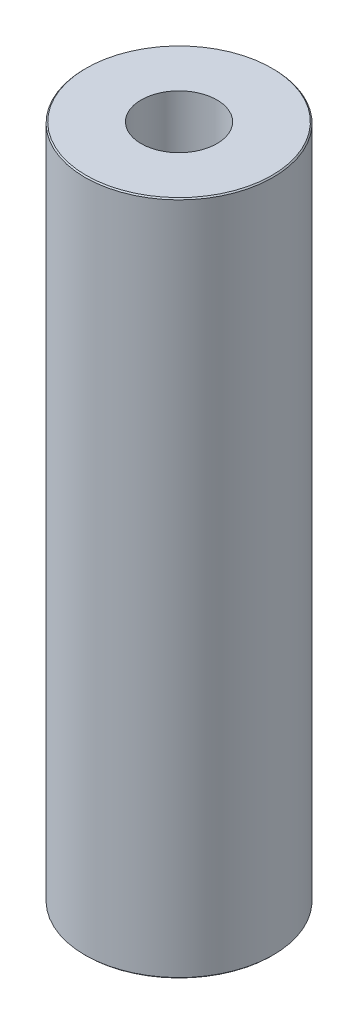
ISO-10303-21;
HEADER;
FILE_DESCRIPTION(('STEP AP214'),'2;1');
FILE_NAME('part.step','',(''),(''),'','','');
FILE_SCHEMA(('AUTOMOTIVE_DESIGN { 1 0 10303 214 1 1 1 1 }'));
ENDSEC;
DATA;
#1=APPLICATION_CONTEXT('core data for automotive mechanical design processes');
#2=APPLICATION_PROTOCOL_DEFINITION('international standard','automotive_design',2000,#1);
#3=PRODUCT_CONTEXT('',#1,'mechanical');
#4=PRODUCT('Part','Part','',(#3));
#5=PRODUCT_RELATED_PRODUCT_CATEGORY('part','',(#4));
#6=PRODUCT_DEFINITION_FORMATION('','',#4);
#7=PRODUCT_DEFINITION_CONTEXT('part definition',#1,'design');
#8=PRODUCT_DEFINITION('design','',#6,#7);
#9=PRODUCT_DEFINITION_SHAPE('','',#8);
#10=(LENGTH_UNIT() NAMED_UNIT(*) SI_UNIT(.MILLI.,.METRE.));
#11=(NAMED_UNIT(*) PLANE_ANGLE_UNIT() SI_UNIT($,.RADIAN.));
#12=(NAMED_UNIT(*) SI_UNIT($,.STERADIAN.) SOLID_ANGLE_UNIT());
#13=UNCERTAINTY_MEASURE_WITH_UNIT(LENGTH_MEASURE(1.E-05),#10,'distance_accuracy_value','');
#14=(GEOMETRIC_REPRESENTATION_CONTEXT(3) GLOBAL_UNCERTAINTY_ASSIGNED_CONTEXT((#13)) GLOBAL_UNIT_ASSIGNED_CONTEXT((#10,
#11,#12)) REPRESENTATION_CONTEXT('',''));
#15=CARTESIAN_POINT('',(0.,0.,0.));
#16=DIRECTION('',(0.,0.,1.));
#17=DIRECTION('',(1.,0.,0.));
#18=AXIS2_PLACEMENT_3D('',#15,#16,#17);
#19=CARTESIAN_POINT('',(0.,197.617170399694,0.));
#20=DIRECTION('',(0.,-1.,0.));
#21=DIRECTION('',(0.,0.,-1.));
#22=AXIS2_PLACEMENT_3D('',#19,#20,#21);
#23=CYLINDRICAL_SURFACE('',#22,27.5);
#24=CARTESIAN_POINT('',(0.,197.275503150878,0.));
#25=DIRECTION('',(0.,1.,0.));
#26=DIRECTION('',(0.,0.,1.));
#27=AXIS2_PLACEMENT_3D('',#24,#25,#26);
#28=CIRCLE('',#27,27.5);
#29=CARTESIAN_POINT('',(0.,197.275503150878,27.5));
#30=VERTEX_POINT('',#29);
#31=EDGE_CURVE('E50',#30,#30,#28,.F.);
#32=ORIENTED_EDGE('',*,*,#31,.T.);
#33=EDGE_LOOP('',(#32));
#34=FACE_BOUND('',#33,.T.);
#35=CARTESIAN_POINT('',(0.,0.341667248815597,0.));
#36=DIRECTION('',(0.,1.,0.));
#37=DIRECTION('',(0.,0.,1.));
#38=AXIS2_PLACEMENT_3D('',#35,#36,#37);
#39=CIRCLE('',#38,27.5);
#40=CARTESIAN_POINT('',(0.,0.341667248815597,27.5));
#41=VERTEX_POINT('',#40);
#42=EDGE_CURVE('E51',#41,#41,#39,.T.);
#43=ORIENTED_EDGE('',*,*,#42,.T.);
#44=EDGE_LOOP('',(#43));
#45=FACE_BOUND('',#44,.T.);
#46=ADVANCED_FACE('F39',(#34,#45),#23,.T.);
#47=CARTESIAN_POINT('',(0.,197.617170399694,0.));
#48=DIRECTION('',(0.,1.,0.));
#49=DIRECTION('',(0.,0.,1.));
#50=AXIS2_PLACEMENT_3D('',#47,#48,#49);
#51=PLANE('',#50);
#52=CARTESIAN_POINT('',(0.,197.617170399694,0.));
#53=DIRECTION('',(0.,1.,0.));
#54=DIRECTION('',(0.,0.,1.));
#55=AXIS2_PLACEMENT_3D('',#52,#53,#54);
#56=CIRCLE('',#55,27.1583327511844);
#57=CARTESIAN_POINT('',(0.,197.617170399694,27.1583327511844));
#58=VERTEX_POINT('',#57);
#59=EDGE_CURVE('E54',#58,#58,#56,.T.);
#60=ORIENTED_EDGE('',*,*,#59,.T.);
#61=EDGE_LOOP('',(#60));
#62=FACE_BOUND('',#61,.T.);
#63=CARTESIAN_POINT('',(0.,197.617170399694,0.));
#64=DIRECTION('',(0.,1.,0.));
#65=DIRECTION('',(0.,0.,1.));
#66=AXIS2_PLACEMENT_3D('',#63,#64,#65);
#67=CIRCLE('',#66,11.0870021897585);
#68=CARTESIAN_POINT('',(0.,197.617170399694,11.0870021897585));
#69=VERTEX_POINT('',#68);
#70=EDGE_CURVE('E58',#69,#69,#67,.T.);
#71=ORIENTED_EDGE('',*,*,#70,.F.);
#72=EDGE_LOOP('',(#71));
#73=FACE_BOUND('',#72,.T.);
#74=ADVANCED_FACE('F69',(#62,#73),#51,.T.);
#75=CARTESIAN_POINT('',(0.,0.,0.));
#76=DIRECTION('',(0.,1.,0.));
#77=DIRECTION('',(0.,0.,1.));
#78=AXIS2_PLACEMENT_3D('',#75,#76,#77);
#79=PLANE('',#78);
#80=CARTESIAN_POINT('',(0.,0.,0.));
#81=DIRECTION('',(0.,1.,0.));
#82=DIRECTION('',(0.,0.,1.));
#83=AXIS2_PLACEMENT_3D('',#80,#81,#82);
#84=CIRCLE('',#83,27.1583327511844);
#85=CARTESIAN_POINT('',(0.,0.,27.1583327511844));
#86=VERTEX_POINT('',#85);
#87=EDGE_CURVE('E10',#86,#86,#84,.F.);
#88=ORIENTED_EDGE('',*,*,#87,.T.);
#89=EDGE_LOOP('',(#88));
#90=FACE_BOUND('',#89,.T.);
#91=CARTESIAN_POINT('',(0.,0.,0.));
#92=DIRECTION('',(0.,1.,0.));
#93=DIRECTION('',(0.,0.,1.));
#94=AXIS2_PLACEMENT_3D('',#91,#92,#93);
#95=CIRCLE('',#94,11.0870021897585);
#96=CARTESIAN_POINT('',(0.,0.,11.0870021897585));
#97=VERTEX_POINT('',#96);
#98=EDGE_CURVE('E63',#97,#97,#95,.T.);
#99=ORIENTED_EDGE('',*,*,#98,.T.);
#100=EDGE_LOOP('',(#99));
#101=FACE_BOUND('',#100,.T.);
#102=ADVANCED_FACE('F75',(#90,#101),#79,.F.);
#103=CARTESIAN_POINT('',(0.,197.617170399694,0.));
#104=DIRECTION('',(0.,-1.,0.));
#105=DIRECTION('',(0.,0.,-1.));
#106=AXIS2_PLACEMENT_3D('',#103,#104,#105);
#107=CYLINDRICAL_SURFACE('',#106,11.0870021897585);
#108=ORIENTED_EDGE('',*,*,#70,.T.);
#109=EDGE_LOOP('',(#108));
#110=FACE_BOUND('',#109,.T.);
#111=ORIENTED_EDGE('',*,*,#98,.F.);
#112=EDGE_LOOP('',(#111));
#113=FACE_BOUND('',#112,.T.);
#114=ADVANCED_FACE('F70',(#110,#113),#107,.F.);
#115=CARTESIAN_POINT('',(0.,197.617170399694,0.));
#116=DIRECTION('',(0.,-1.,0.));
#117=DIRECTION('',(0.,0.,-1.));
#118=AXIS2_PLACEMENT_3D('',#115,#116,#117);
#119=CONICAL_SURFACE('',#118,27.1583327511844,0.785398163397458);
#120=ORIENTED_EDGE('',*,*,#31,.F.);
#121=EDGE_LOOP('',(#120));
#122=FACE_BOUND('',#121,.T.);
#123=ORIENTED_EDGE('',*,*,#59,.F.);
#124=EDGE_LOOP('',(#123));
#125=FACE_BOUND('',#124,.T.);
#126=ADVANCED_FACE('F81',(#122,#125),#119,.T.);
#127=CARTESIAN_POINT('',(0.,0.341667248815597,0.));
#128=DIRECTION('',(0.,1.,0.));
#129=DIRECTION('',(0.,0.,1.));
#130=AXIS2_PLACEMENT_3D('',#127,#128,#129);
#131=CONICAL_SURFACE('',#130,27.5,0.785398163397418);
#132=CARTESIAN_POINT('',(0.,0.,27.1583327511844));
#133=CARTESIAN_POINT('',(0.,0.00355903384182908,27.1618917850263));
#134=CARTESIAN_POINT('',(0.,0.00711806768365822,27.1654508188681));
#135=CARTESIAN_POINT('',(0.,0.0142361353673165,27.1725688865517));
#136=CARTESIAN_POINT('',(0.,0.0177951692091456,27.1761279203936));
#137=CARTESIAN_POINT('',(0.,0.0249132368928039,27.1832459880772));
#138=CARTESIAN_POINT('',(0.,0.028472270734633,27.1868050219191));
#139=CARTESIAN_POINT('',(0.,0.0355903384182913,27.1939230896027));
#140=CARTESIAN_POINT('',(0.,0.0391493722601204,27.1974821234445));
#141=CARTESIAN_POINT('',(0.,0.0462674399437787,27.2046001911282));
#142=CARTESIAN_POINT('',(0.,0.0498264737856078,27.20815922497));
#143=CARTESIAN_POINT('',(0.,0.0569445414692661,27.2152772926537));
#144=CARTESIAN_POINT('',(0.,0.0605035753110953,27.2188363264955));
#145=CARTESIAN_POINT('',(0.,0.0676216429947535,27.2259543941792));
#146=CARTESIAN_POINT('',(0.,0.0711806768365825,27.229513428021));
#147=CARTESIAN_POINT('',(0.,0.078298744520241,27.2366314957047));
#148=CARTESIAN_POINT('',(0.,0.0818577783620704,27.2401905295465));
#149=CARTESIAN_POINT('',(0.,0.0889758460457285,27.2473085972301));
#150=CARTESIAN_POINT('',(0.,0.0925348798875572,27.250867631072));
#151=CARTESIAN_POINT('',(0.,0.0996529475712154,27.2579856987556));
#152=CARTESIAN_POINT('',(0.,0.103211981413045,27.2615447325975));
#153=CARTESIAN_POINT('',(0.,0.110330049096703,27.2686628002811));
#154=CARTESIAN_POINT('',(0.,0.113889082938532,27.272221834123));
#155=CARTESIAN_POINT('',(0.,0.121007150622191,27.2793399018066));
#156=CARTESIAN_POINT('',(0.,0.12456618446402,27.2828989356484));
#157=CARTESIAN_POINT('',(0.,0.131684252147678,27.2900170033321));
#158=CARTESIAN_POINT('',(0.,0.135243285989507,27.2935760371739));
#159=CARTESIAN_POINT('',(0.,0.142361353673165,27.3006941048576));
#160=CARTESIAN_POINT('',(0.,0.145920387514995,27.3042531386994));
#161=CARTESIAN_POINT('',(0.,0.153038455198653,27.3113712063831));
#162=CARTESIAN_POINT('',(0.,0.156597489040482,27.3149302402249));
#163=CARTESIAN_POINT('',(0.,0.16371555672414,27.3220483079086));
#164=CARTESIAN_POINT('',(0.,0.167274590565969,27.3256073417504));
#165=CARTESIAN_POINT('',(0.,0.174392658249628,27.332725409434));
#166=CARTESIAN_POINT('',(0.,0.177951692091457,27.3362844432759));
#167=CARTESIAN_POINT('',(0.,0.185069759775115,27.3434025109595));
#168=CARTESIAN_POINT('',(0.,0.188628793616944,27.3469615448014));
#169=CARTESIAN_POINT('',(0.,0.195746861300602,27.354079612485));
#170=CARTESIAN_POINT('',(0.,0.199305895142432,27.3576386463268));
#171=CARTESIAN_POINT('',(0.,0.20642396282609,27.3647567140105));
#172=CARTESIAN_POINT('',(0.,0.209982996667919,27.3683157478523));
#173=CARTESIAN_POINT('',(0.,0.217101064351577,27.375433815536));
#174=CARTESIAN_POINT('',(0.,0.220660098193406,27.3789928493778));
#175=CARTESIAN_POINT('',(0.,0.227778165877065,27.3861109170615));
#176=CARTESIAN_POINT('',(0.,0.231337199718894,27.3896699509033));
#177=CARTESIAN_POINT('',(0.,0.238455267402552,27.396788018587));
#178=CARTESIAN_POINT('',(0.,0.242014301244382,27.4003470524288));
#179=CARTESIAN_POINT('',(0.,0.24913236892804,27.4074651201125));
#180=CARTESIAN_POINT('',(0.,0.252691402769868,27.4110241539543));
#181=CARTESIAN_POINT('',(0.,0.259809470453527,27.4181422216379));
#182=CARTESIAN_POINT('',(0.,0.263368504295356,27.4217012554798));
#183=CARTESIAN_POINT('',(0.,0.270486571979014,27.4288193231634));
#184=CARTESIAN_POINT('',(0.,0.274045605820843,27.4323783570053));
#185=CARTESIAN_POINT('',(0.,0.281163673504502,27.4394964246889));
#186=CARTESIAN_POINT('',(0.,0.284722707346331,27.4430554585307));
#187=CARTESIAN_POINT('',(0.,0.291840775029989,27.4501735262144));
#188=CARTESIAN_POINT('',(0.,0.295399808871818,27.4537325600562));
#189=CARTESIAN_POINT('',(0.,0.302517876555476,27.4608506277399));
#190=CARTESIAN_POINT('',(0.,0.306076910397306,27.4644096615817));
#191=CARTESIAN_POINT('',(0.,0.313194978080964,27.4715277292654));
#192=CARTESIAN_POINT('',(0.,0.316754011922793,27.4750867631072));
#193=CARTESIAN_POINT('',(0.,0.323872079606451,27.4822048307909));
#194=CARTESIAN_POINT('',(0.,0.32743111344828,27.4857638646327));
#195=CARTESIAN_POINT('',(0.,0.334549181131939,27.4928819323163));
#196=CARTESIAN_POINT('',(0.,0.338108214973768,27.4964409661582));
#197=CARTESIAN_POINT('',(0.,0.341667248815597,27.5));
#198=B_SPLINE_CURVE_WITH_KNOTS('',3,(#132,#133,#134,#135,#136,#137,#138,#139,#140,#141,#142,
#143,#144,#145,#146,#147,#148,#149,#150,#151,#152,#153,#154,#155,#156,#157,#158,#159,#160,#161,
#162,#163,#164,#165,#166,#167,#168,#169,#170,#171,#172,#173,#174,#175,#176,#177,#178,#179,#180,
#181,#182,#183,#184,#185,#186,#187,#188,#189,#190,#191,#192,#193,#194,#195,#196,#197),
.UNSPECIFIED.,.F.,.F.,(4,2,2,2,2,2,2,2,2,2,2,2,2,2,2,2,2,2,2,2,2,2,2,2,2,2,2,2,2,2,2,2,4),(0.,
0.0150997017841781,0.0301994035683563,0.0452991053525344,0.0603988071367125,0.0754985089208907,
0.0905982107050688,0.105697912489247,0.120797614273425,0.135897316057606,0.150997017841784,
0.166096719625962,0.18119642141014,0.196296123194318,0.211395824978496,0.226495526762675,
0.241595228546853,0.256694930331031,0.271794632115209,0.286894333899387,0.301994035683565,
0.317093737467743,0.332193439251922,0.3472931410361,0.36239284282028,0.377492544604458,
0.392592246388637,0.407691948172815,0.422791649956993,0.437891351741171,0.452991053525349,
0.468090755309527,0.483190457093706),.UNSPECIFIED.);
#199=EDGE_CURVE('BSEAM45',#86,#41,#198,.T.);
#200=ORIENTED_EDGE('',*,*,#87,.F.);
#201=ORIENTED_EDGE('',*,*,#42,.F.);
#202=ORIENTED_EDGE('',*,*,#199,.T.);
#203=ORIENTED_EDGE('',*,*,#199,.F.);
#204=EDGE_LOOP('',(#200,#202,#201,#203));
#205=FACE_BOUND('',#204,.T.);
#206=ADVANCED_FACE('F45',(#205),#131,.T.);
#207=CLOSED_SHELL('',(#46,#74,#102,#114,#126,#206));
#208=MANIFOLD_SOLID_BREP('B2',#207);
#209=ADVANCED_BREP_SHAPE_REPRESENTATION('',(#18,#208),#14);
#210=SHAPE_DEFINITION_REPRESENTATION(#9,#209);
ENDSEC;
END-ISO-10303-21;
